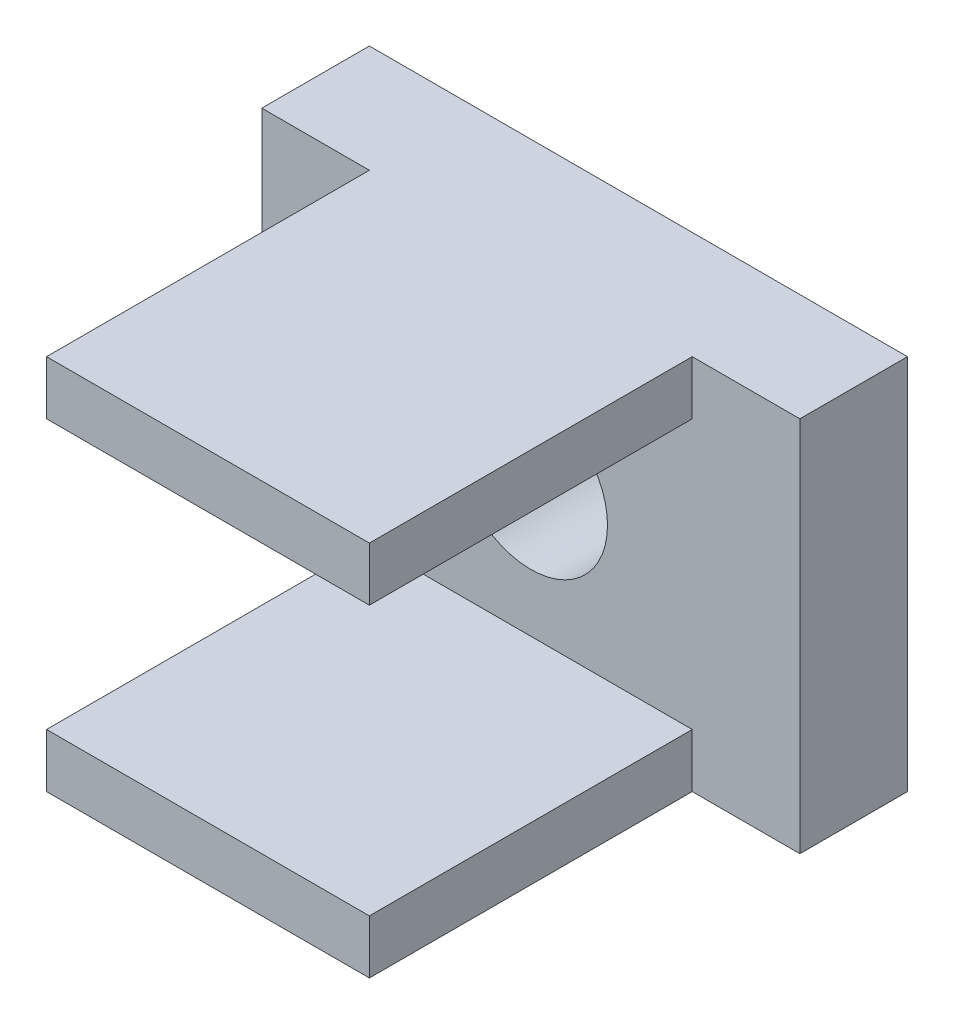
ISO-10303-21;
HEADER;
FILE_DESCRIPTION(('STEP AP214'),'2;1');
FILE_NAME('part.step','',(''),(''),'','','');
FILE_SCHEMA(('AUTOMOTIVE_DESIGN { 1 0 10303 214 1 1 1 1 }'));
ENDSEC;
DATA;
#1=APPLICATION_CONTEXT('core data for automotive mechanical design processes');
#2=APPLICATION_PROTOCOL_DEFINITION('international standard','automotive_design',2000,#1);
#3=PRODUCT_CONTEXT('',#1,'mechanical');
#4=PRODUCT('Part','Part','',(#3));
#5=PRODUCT_RELATED_PRODUCT_CATEGORY('part','',(#4));
#6=PRODUCT_DEFINITION_FORMATION('','',#4);
#7=PRODUCT_DEFINITION_CONTEXT('part definition',#1,'design');
#8=PRODUCT_DEFINITION('design','',#6,#7);
#9=PRODUCT_DEFINITION_SHAPE('','',#8);
#10=(LENGTH_UNIT() NAMED_UNIT(*) SI_UNIT(.MILLI.,.METRE.));
#11=(NAMED_UNIT(*) PLANE_ANGLE_UNIT() SI_UNIT($,.RADIAN.));
#12=(NAMED_UNIT(*) SI_UNIT($,.STERADIAN.) SOLID_ANGLE_UNIT());
#13=UNCERTAINTY_MEASURE_WITH_UNIT(LENGTH_MEASURE(1.E-05),#10,'distance_accuracy_value','');
#14=(GEOMETRIC_REPRESENTATION_CONTEXT(3) GLOBAL_UNCERTAINTY_ASSIGNED_CONTEXT((#13)) GLOBAL_UNIT_ASSIGNED_CONTEXT((#10,
#11,#12)) REPRESENTATION_CONTEXT('',''));
#15=CARTESIAN_POINT('',(0.,0.,0.));
#16=DIRECTION('',(0.,0.,1.));
#17=DIRECTION('',(1.,0.,0.));
#18=AXIS2_PLACEMENT_3D('',#15,#16,#17);
#19=CARTESIAN_POINT('',(0.,0.,1.));
#20=DIRECTION('',(0.,0.,-1.));
#21=DIRECTION('',(-1.,0.,0.));
#22=AXIS2_PLACEMENT_3D('',#19,#20,#21);
#23=PLANE('',#22);
#24=CARTESIAN_POINT('',(0.,0.,1.));
#25=DIRECTION('',(0.,0.,1.));
#26=DIRECTION('',(1.,0.,0.));
#27=AXIS2_PLACEMENT_3D('',#24,#25,#26);
#28=CIRCLE('',#27,1.425);
#29=CARTESIAN_POINT('',(1.425,0.,1.));
#30=VERTEX_POINT('',#29);
#31=EDGE_CURVE('E200',#30,#30,#28,.T.);
#32=ORIENTED_EDGE('',*,*,#31,.F.);
#33=EDGE_LOOP('',(#32));
#34=FACE_BOUND('',#33,.T.);
#35=DIRECTION('',(0.,1.,0.));
#36=VECTOR('',#35,1.);
#37=CARTESIAN_POINT('',(3.,-3.5,1.));
#38=LINE('',#37,#36);
#39=CARTESIAN_POINT('',(3.,-3.5,1.));
#40=VERTEX_POINT('',#39);
#41=CARTESIAN_POINT('',(3.,-2.5,1.));
#42=VERTEX_POINT('',#41);
#43=EDGE_CURVE('E151',#40,#42,#38,.T.);
#44=ORIENTED_EDGE('',*,*,#43,.F.);
#45=DIRECTION('',(1.,0.,0.));
#46=VECTOR('',#45,1.);
#47=CARTESIAN_POINT('',(5.,-3.5,1.));
#48=LINE('',#47,#46);
#49=CARTESIAN_POINT('',(5.,-3.5,1.));
#50=VERTEX_POINT('',#49);
#51=EDGE_CURVE('E213',#40,#50,#48,.T.);
#52=ORIENTED_EDGE('',*,*,#51,.T.);
#53=DIRECTION('',(0.,1.,0.));
#54=VECTOR('',#53,1.);
#55=CARTESIAN_POINT('',(5.,3.5,1.));
#56=LINE('',#55,#54);
#57=CARTESIAN_POINT('',(5.,3.5,1.));
#58=VERTEX_POINT('',#57);
#59=EDGE_CURVE('E218',#50,#58,#56,.T.);
#60=ORIENTED_EDGE('',*,*,#59,.T.);
#61=DIRECTION('',(-1.,0.,0.));
#62=VECTOR('',#61,1.);
#63=CARTESIAN_POINT('',(5.,3.5,1.));
#64=LINE('',#63,#62);
#65=CARTESIAN_POINT('',(3.,3.5,1.));
#66=VERTEX_POINT('',#65);
#67=EDGE_CURVE('E222',#58,#66,#64,.T.);
#68=ORIENTED_EDGE('',*,*,#67,.T.);
#69=DIRECTION('',(0.,1.,0.));
#70=VECTOR('',#69,1.);
#71=CARTESIAN_POINT('',(3.,3.5,1.));
#72=LINE('',#71,#70);
#73=CARTESIAN_POINT('',(3.,2.5,1.));
#74=VERTEX_POINT('',#73);
#75=EDGE_CURVE('E169',#74,#66,#72,.T.);
#76=ORIENTED_EDGE('',*,*,#75,.F.);
#77=DIRECTION('',(1.,0.,0.));
#78=VECTOR('',#77,1.);
#79=CARTESIAN_POINT('',(-3.,2.5,1.));
#80=LINE('',#79,#78);
#81=CARTESIAN_POINT('',(-3.,2.5,1.));
#82=VERTEX_POINT('',#81);
#83=EDGE_CURVE('E158',#82,#74,#80,.T.);
#84=ORIENTED_EDGE('',*,*,#83,.F.);
#85=DIRECTION('',(0.,-1.,0.));
#86=VECTOR('',#85,1.);
#87=CARTESIAN_POINT('',(-3.,3.5,1.));
#88=LINE('',#87,#86);
#89=CARTESIAN_POINT('',(-3.,3.5,1.));
#90=VERTEX_POINT('',#89);
#91=EDGE_CURVE('E153',#90,#82,#88,.T.);
#92=ORIENTED_EDGE('',*,*,#91,.F.);
#93=CARTESIAN_POINT('',(-5.,3.5,1.));
#94=VERTEX_POINT('',#93);
#95=EDGE_CURVE('E221',#90,#94,#64,.T.);
#96=ORIENTED_EDGE('',*,*,#95,.T.);
#97=DIRECTION('',(0.,-1.,0.));
#98=VECTOR('',#97,1.);
#99=CARTESIAN_POINT('',(-5.,3.5,1.));
#100=LINE('',#99,#98);
#101=CARTESIAN_POINT('',(-5.,-3.5,1.));
#102=VERTEX_POINT('',#101);
#103=EDGE_CURVE('E209',#94,#102,#100,.T.);
#104=ORIENTED_EDGE('',*,*,#103,.T.);
#105=CARTESIAN_POINT('',(-3.,-3.5,1.));
#106=VERTEX_POINT('',#105);
#107=EDGE_CURVE('E215',#102,#106,#48,.T.);
#108=ORIENTED_EDGE('',*,*,#107,.T.);
#109=DIRECTION('',(0.,-1.,0.));
#110=VECTOR('',#109,1.);
#111=CARTESIAN_POINT('',(-3.,-3.5,1.));
#112=LINE('',#111,#110);
#113=CARTESIAN_POINT('',(-3.,-2.5,1.));
#114=VERTEX_POINT('',#113);
#115=EDGE_CURVE('E60',#114,#106,#112,.T.);
#116=ORIENTED_EDGE('',*,*,#115,.F.);
#117=DIRECTION('',(-1.,0.,0.));
#118=VECTOR('',#117,1.);
#119=CARTESIAN_POINT('',(3.,-2.5,1.));
#120=LINE('',#119,#118);
#121=EDGE_CURVE('E55',#42,#114,#120,.T.);
#122=ORIENTED_EDGE('',*,*,#121,.F.);
#123=EDGE_LOOP('',(#44,#52,#60,#68,#76,#84,#92,#96,#104,#108,#116,#122));
#124=FACE_BOUND('',#123,.T.);
#125=ADVANCED_FACE('F39',(#34,#124),#23,.F.);
#126=CARTESIAN_POINT('',(-5.,3.5,1.));
#127=DIRECTION('',(1.,0.,0.));
#128=DIRECTION('',(0.,1.,0.));
#129=AXIS2_PLACEMENT_3D('',#126,#127,#128);
#130=PLANE('',#129);
#131=DIRECTION('',(0.,-1.,0.));
#132=VECTOR('',#131,1.);
#133=CARTESIAN_POINT('',(-5.,3.5,-1.));
#134=LINE('',#133,#132);
#135=CARTESIAN_POINT('',(-5.,3.5,-1.));
#136=VERTEX_POINT('',#135);
#137=CARTESIAN_POINT('',(-5.,-3.5,-1.));
#138=VERTEX_POINT('',#137);
#139=EDGE_CURVE('E205',#136,#138,#134,.T.);
#140=ORIENTED_EDGE('',*,*,#139,.T.);
#141=DIRECTION('',(0.,0.,-1.));
#142=VECTOR('',#141,1.);
#143=CARTESIAN_POINT('',(-5.,-3.5,1.));
#144=LINE('',#143,#142);
#145=EDGE_CURVE('E11',#102,#138,#144,.T.);
#146=ORIENTED_EDGE('',*,*,#145,.F.);
#147=ORIENTED_EDGE('',*,*,#103,.F.);
#148=DIRECTION('',(0.,0.,-1.));
#149=VECTOR('',#148,1.);
#150=CARTESIAN_POINT('',(-5.,3.5,1.));
#151=LINE('',#150,#149);
#152=EDGE_CURVE('E225',#94,#136,#151,.T.);
#153=ORIENTED_EDGE('',*,*,#152,.T.);
#154=EDGE_LOOP('',(#140,#146,#147,#153));
#155=FACE_BOUND('',#154,.T.);
#156=ADVANCED_FACE('F41',(#155),#130,.F.);
#157=CARTESIAN_POINT('',(5.,-3.5,1.));
#158=DIRECTION('',(0.,1.,0.));
#159=DIRECTION('',(-1.,0.,0.));
#160=AXIS2_PLACEMENT_3D('',#157,#158,#159);
#161=PLANE('',#160);
#162=DIRECTION('',(1.,0.,0.));
#163=VECTOR('',#162,1.);
#164=CARTESIAN_POINT('',(5.,-3.5,-1.));
#165=LINE('',#164,#163);
#166=CARTESIAN_POINT('',(5.,-3.5,-1.));
#167=VERTEX_POINT('',#166);
#168=EDGE_CURVE('E229',#138,#167,#165,.T.);
#169=ORIENTED_EDGE('',*,*,#168,.T.);
#170=DIRECTION('',(0.,0.,-1.));
#171=VECTOR('',#170,1.);
#172=CARTESIAN_POINT('',(5.,-3.5,1.));
#173=LINE('',#172,#171);
#174=EDGE_CURVE('E48',#50,#167,#173,.T.);
#175=ORIENTED_EDGE('',*,*,#174,.F.);
#176=ORIENTED_EDGE('',*,*,#51,.F.);
#177=DIRECTION('',(0.,0.,-1.));
#178=VECTOR('',#177,1.);
#179=CARTESIAN_POINT('',(3.,-3.5,7.));
#180=LINE('',#179,#178);
#181=CARTESIAN_POINT('',(3.,-3.5,7.));
#182=VERTEX_POINT('',#181);
#183=EDGE_CURVE('E268',#182,#40,#180,.T.);
#184=ORIENTED_EDGE('',*,*,#183,.F.);
#185=DIRECTION('',(1.,0.,0.));
#186=VECTOR('',#185,1.);
#187=CARTESIAN_POINT('',(3.,-3.5,7.));
#188=LINE('',#187,#186);
#189=CARTESIAN_POINT('',(-3.,-3.5,7.));
#190=VERTEX_POINT('',#189);
#191=EDGE_CURVE('E144',#190,#182,#188,.T.);
#192=ORIENTED_EDGE('',*,*,#191,.F.);
#193=DIRECTION('',(0.,0.,-1.));
#194=VECTOR('',#193,1.);
#195=CARTESIAN_POINT('',(-3.,-3.5,7.));
#196=LINE('',#195,#194);
#197=EDGE_CURVE('E160',#190,#106,#196,.T.);
#198=ORIENTED_EDGE('',*,*,#197,.T.);
#199=ORIENTED_EDGE('',*,*,#107,.F.);
#200=ORIENTED_EDGE('',*,*,#145,.T.);
#201=EDGE_LOOP('',(#169,#175,#176,#184,#192,#198,#199,#200));
#202=FACE_BOUND('',#201,.T.);
#203=ADVANCED_FACE('F267',(#202),#161,.F.);
#204=CARTESIAN_POINT('',(5.,3.5,1.));
#205=DIRECTION('',(-1.,0.,0.));
#206=DIRECTION('',(0.,-1.,0.));
#207=AXIS2_PLACEMENT_3D('',#204,#205,#206);
#208=PLANE('',#207);
#209=DIRECTION('',(0.,1.,0.));
#210=VECTOR('',#209,1.);
#211=CARTESIAN_POINT('',(5.,3.5,-1.));
#212=LINE('',#211,#210);
#213=CARTESIAN_POINT('',(5.,3.5,-1.));
#214=VERTEX_POINT('',#213);
#215=EDGE_CURVE('E232',#167,#214,#212,.T.);
#216=ORIENTED_EDGE('',*,*,#215,.T.);
#217=DIRECTION('',(0.,0.,-1.));
#218=VECTOR('',#217,1.);
#219=CARTESIAN_POINT('',(5.,3.5,1.));
#220=LINE('',#219,#218);
#221=EDGE_CURVE('E240',#58,#214,#220,.T.);
#222=ORIENTED_EDGE('',*,*,#221,.F.);
#223=ORIENTED_EDGE('',*,*,#59,.F.);
#224=ORIENTED_EDGE('',*,*,#174,.T.);
#225=EDGE_LOOP('',(#216,#222,#223,#224));
#226=FACE_BOUND('',#225,.T.);
#227=ADVANCED_FACE('F249',(#226),#208,.F.);
#228=CARTESIAN_POINT('',(5.,3.5,1.));
#229=DIRECTION('',(0.,-1.,0.));
#230=DIRECTION('',(1.,0.,0.));
#231=AXIS2_PLACEMENT_3D('',#228,#229,#230);
#232=PLANE('',#231);
#233=DIRECTION('',(-1.,0.,0.));
#234=VECTOR('',#233,1.);
#235=CARTESIAN_POINT('',(5.,3.5,-1.));
#236=LINE('',#235,#234);
#237=EDGE_CURVE('E214',#214,#136,#236,.T.);
#238=ORIENTED_EDGE('',*,*,#237,.T.);
#239=ORIENTED_EDGE('',*,*,#152,.F.);
#240=ORIENTED_EDGE('',*,*,#95,.F.);
#241=DIRECTION('',(0.,0.,-1.));
#242=VECTOR('',#241,1.);
#243=CARTESIAN_POINT('',(-3.,3.5,7.));
#244=LINE('',#243,#242);
#245=CARTESIAN_POINT('',(-3.,3.5,7.));
#246=VERTEX_POINT('',#245);
#247=EDGE_CURVE('E177',#246,#90,#244,.T.);
#248=ORIENTED_EDGE('',*,*,#247,.F.);
#249=DIRECTION('',(-1.,0.,0.));
#250=VECTOR('',#249,1.);
#251=CARTESIAN_POINT('',(-3.,3.5,7.));
#252=LINE('',#251,#250);
#253=CARTESIAN_POINT('',(3.,3.5,7.));
#254=VERTEX_POINT('',#253);
#255=EDGE_CURVE('E175',#254,#246,#252,.T.);
#256=ORIENTED_EDGE('',*,*,#255,.F.);
#257=DIRECTION('',(0.,0.,-1.));
#258=VECTOR('',#257,1.);
#259=CARTESIAN_POINT('',(3.,3.5,7.));
#260=LINE('',#259,#258);
#261=EDGE_CURVE('E188',#254,#66,#260,.T.);
#262=ORIENTED_EDGE('',*,*,#261,.T.);
#263=ORIENTED_EDGE('',*,*,#67,.F.);
#264=ORIENTED_EDGE('',*,*,#221,.T.);
#265=EDGE_LOOP('',(#238,#239,#240,#248,#256,#262,#263,#264));
#266=FACE_BOUND('',#265,.T.);
#267=ADVANCED_FACE('F258',(#266),#232,.F.);
#268=CARTESIAN_POINT('',(0.,0.,-1.));
#269=DIRECTION('',(0.,0.,-1.));
#270=DIRECTION('',(-1.,0.,0.));
#271=AXIS2_PLACEMENT_3D('',#268,#269,#270);
#272=PLANE('',#271);
#273=CARTESIAN_POINT('',(0.,0.,-1.));
#274=DIRECTION('',(0.,0.,1.));
#275=DIRECTION('',(1.,0.,0.));
#276=AXIS2_PLACEMENT_3D('',#273,#274,#275);
#277=CIRCLE('',#276,1.425);
#278=CARTESIAN_POINT('',(1.425,0.,-1.));
#279=VERTEX_POINT('',#278);
#280=EDGE_CURVE('E201',#279,#279,#277,.T.);
#281=ORIENTED_EDGE('',*,*,#280,.T.);
#282=EDGE_LOOP('',(#281));
#283=FACE_BOUND('',#282,.T.);
#284=ORIENTED_EDGE('',*,*,#139,.F.);
#285=ORIENTED_EDGE('',*,*,#237,.F.);
#286=ORIENTED_EDGE('',*,*,#215,.F.);
#287=ORIENTED_EDGE('',*,*,#168,.F.);
#288=EDGE_LOOP('',(#284,#285,#286,#287));
#289=FACE_BOUND('',#288,.T.);
#290=ADVANCED_FACE('F255',(#283,#289),#272,.T.);
#291=CARTESIAN_POINT('',(0.,0.,-1.));
#292=DIRECTION('',(0.,0.,1.));
#293=DIRECTION('',(1.,0.,0.));
#294=AXIS2_PLACEMENT_3D('',#291,#292,#293);
#295=CYLINDRICAL_SURFACE('',#294,1.425);
#296=ORIENTED_EDGE('',*,*,#280,.F.);
#297=EDGE_LOOP('',(#296));
#298=FACE_BOUND('',#297,.T.);
#299=ORIENTED_EDGE('',*,*,#31,.T.);
#300=EDGE_LOOP('',(#299));
#301=FACE_BOUND('',#300,.T.);
#302=ADVANCED_FACE('F303',(#298,#301),#295,.F.);
#303=CARTESIAN_POINT('',(-3.,3.5,7.));
#304=DIRECTION('',(1.,0.,0.));
#305=DIRECTION('',(0.,0.,-1.));
#306=AXIS2_PLACEMENT_3D('',#303,#304,#305);
#307=PLANE('',#306);
#308=ORIENTED_EDGE('',*,*,#91,.T.);
#309=DIRECTION('',(0.,0.,-1.));
#310=VECTOR('',#309,1.);
#311=CARTESIAN_POINT('',(-3.,2.5,7.));
#312=LINE('',#311,#310);
#313=CARTESIAN_POINT('',(-3.,2.5,7.));
#314=VERTEX_POINT('',#313);
#315=EDGE_CURVE('E196',#314,#82,#312,.T.);
#316=ORIENTED_EDGE('',*,*,#315,.F.);
#317=DIRECTION('',(0.,-1.,0.));
#318=VECTOR('',#317,1.);
#319=CARTESIAN_POINT('',(-3.,3.5,7.));
#320=LINE('',#319,#318);
#321=EDGE_CURVE('E164',#246,#314,#320,.T.);
#322=ORIENTED_EDGE('',*,*,#321,.F.);
#323=ORIENTED_EDGE('',*,*,#247,.T.);
#324=EDGE_LOOP('',(#308,#316,#322,#323));
#325=FACE_BOUND('',#324,.T.);
#326=ADVANCED_FACE('F335',(#325),#307,.F.);
#327=CARTESIAN_POINT('',(-3.,2.5,7.));
#328=DIRECTION('',(0.,1.,0.));
#329=DIRECTION('',(-1.,0.,0.));
#330=AXIS2_PLACEMENT_3D('',#327,#328,#329);
#331=PLANE('',#330);
#332=ORIENTED_EDGE('',*,*,#83,.T.);
#333=DIRECTION('',(0.,0.,-1.));
#334=VECTOR('',#333,1.);
#335=CARTESIAN_POINT('',(3.,2.5,7.));
#336=LINE('',#335,#334);
#337=CARTESIAN_POINT('',(3.,2.5,7.));
#338=VERTEX_POINT('',#337);
#339=EDGE_CURVE('E192',#338,#74,#336,.T.);
#340=ORIENTED_EDGE('',*,*,#339,.F.);
#341=DIRECTION('',(1.,0.,0.));
#342=VECTOR('',#341,1.);
#343=CARTESIAN_POINT('',(-3.,2.5,7.));
#344=LINE('',#343,#342);
#345=EDGE_CURVE('E168',#314,#338,#344,.T.);
#346=ORIENTED_EDGE('',*,*,#345,.F.);
#347=ORIENTED_EDGE('',*,*,#315,.T.);
#348=EDGE_LOOP('',(#332,#340,#346,#347));
#349=FACE_BOUND('',#348,.T.);
#350=ADVANCED_FACE('F341',(#349),#331,.F.);
#351=CARTESIAN_POINT('',(3.,3.5,7.));
#352=DIRECTION('',(-1.,0.,0.));
#353=DIRECTION('',(0.,-1.,0.));
#354=AXIS2_PLACEMENT_3D('',#351,#352,#353);
#355=PLANE('',#354);
#356=ORIENTED_EDGE('',*,*,#75,.T.);
#357=ORIENTED_EDGE('',*,*,#261,.F.);
#358=DIRECTION('',(0.,1.,0.));
#359=VECTOR('',#358,1.);
#360=CARTESIAN_POINT('',(3.,3.5,7.));
#361=LINE('',#360,#359);
#362=EDGE_CURVE('E172',#338,#254,#361,.T.);
#363=ORIENTED_EDGE('',*,*,#362,.F.);
#364=ORIENTED_EDGE('',*,*,#339,.T.);
#365=EDGE_LOOP('',(#356,#357,#363,#364));
#366=FACE_BOUND('',#365,.T.);
#367=ADVANCED_FACE('F348',(#366),#355,.F.);
#368=CARTESIAN_POINT('',(0.,0.,7.));
#369=DIRECTION('',(0.,0.,1.));
#370=DIRECTION('',(1.,0.,0.));
#371=AXIS2_PLACEMENT_3D('',#368,#369,#370);
#372=PLANE('',#371);
#373=ORIENTED_EDGE('',*,*,#321,.T.);
#374=ORIENTED_EDGE('',*,*,#345,.T.);
#375=ORIENTED_EDGE('',*,*,#362,.T.);
#376=ORIENTED_EDGE('',*,*,#255,.T.);
#377=EDGE_LOOP('',(#373,#374,#375,#376));
#378=FACE_BOUND('',#377,.T.);
#379=ADVANCED_FACE('F356',(#378),#372,.T.);
#380=CARTESIAN_POINT('',(3.,-3.5,7.));
#381=DIRECTION('',(-1.,0.,0.));
#382=DIRECTION('',(0.,0.,1.));
#383=AXIS2_PLACEMENT_3D('',#380,#381,#382);
#384=PLANE('',#383);
#385=ORIENTED_EDGE('',*,*,#43,.T.);
#386=DIRECTION('',(0.,0.,-1.));
#387=VECTOR('',#386,1.);
#388=CARTESIAN_POINT('',(3.,-2.5,7.));
#389=LINE('',#388,#387);
#390=CARTESIAN_POINT('',(3.,-2.5,7.));
#391=VERTEX_POINT('',#390);
#392=EDGE_CURVE('E131',#391,#42,#389,.T.);
#393=ORIENTED_EDGE('',*,*,#392,.F.);
#394=DIRECTION('',(0.,1.,0.));
#395=VECTOR('',#394,1.);
#396=CARTESIAN_POINT('',(3.,-3.5,7.));
#397=LINE('',#396,#395);
#398=EDGE_CURVE('E139',#182,#391,#397,.T.);
#399=ORIENTED_EDGE('',*,*,#398,.F.);
#400=ORIENTED_EDGE('',*,*,#183,.T.);
#401=EDGE_LOOP('',(#385,#393,#399,#400));
#402=FACE_BOUND('',#401,.T.);
#403=ADVANCED_FACE('F150',(#402),#384,.F.);
#404=CARTESIAN_POINT('',(3.,-2.5,7.));
#405=DIRECTION('',(0.,-1.,0.));
#406=DIRECTION('',(0.,0.,-1.));
#407=AXIS2_PLACEMENT_3D('',#404,#405,#406);
#408=PLANE('',#407);
#409=ORIENTED_EDGE('',*,*,#121,.T.);
#410=DIRECTION('',(0.,0.,-1.));
#411=VECTOR('',#410,1.);
#412=CARTESIAN_POINT('',(-3.,-2.5,7.));
#413=LINE('',#412,#411);
#414=CARTESIAN_POINT('',(-3.,-2.5,7.));
#415=VERTEX_POINT('',#414);
#416=EDGE_CURVE('E134',#415,#114,#413,.T.);
#417=ORIENTED_EDGE('',*,*,#416,.F.);
#418=DIRECTION('',(-1.,0.,0.));
#419=VECTOR('',#418,1.);
#420=CARTESIAN_POINT('',(3.,-2.5,7.));
#421=LINE('',#420,#419);
#422=EDGE_CURVE('E127',#391,#415,#421,.T.);
#423=ORIENTED_EDGE('',*,*,#422,.F.);
#424=ORIENTED_EDGE('',*,*,#392,.T.);
#425=EDGE_LOOP('',(#409,#417,#423,#424));
#426=FACE_BOUND('',#425,.T.);
#427=ADVANCED_FACE('F129',(#426),#408,.F.);
#428=CARTESIAN_POINT('',(-3.,-3.5,7.));
#429=DIRECTION('',(1.,0.,0.));
#430=DIRECTION('',(0.,0.,-1.));
#431=AXIS2_PLACEMENT_3D('',#428,#429,#430);
#432=PLANE('',#431);
#433=ORIENTED_EDGE('',*,*,#115,.T.);
#434=ORIENTED_EDGE('',*,*,#197,.F.);
#435=DIRECTION('',(0.,-1.,0.));
#436=VECTOR('',#435,1.);
#437=CARTESIAN_POINT('',(-3.,-3.5,7.));
#438=LINE('',#437,#436);
#439=EDGE_CURVE('E138',#415,#190,#438,.T.);
#440=ORIENTED_EDGE('',*,*,#439,.F.);
#441=ORIENTED_EDGE('',*,*,#416,.T.);
#442=EDGE_LOOP('',(#433,#434,#440,#441));
#443=FACE_BOUND('',#442,.T.);
#444=ADVANCED_FACE('F285',(#443),#432,.F.);
#445=CARTESIAN_POINT('',(0.,0.,7.));
#446=DIRECTION('',(0.,0.,1.));
#447=DIRECTION('',(1.,0.,0.));
#448=AXIS2_PLACEMENT_3D('',#445,#446,#447);
#449=PLANE('',#448);
#450=ORIENTED_EDGE('',*,*,#398,.T.);
#451=ORIENTED_EDGE('',*,*,#422,.T.);
#452=ORIENTED_EDGE('',*,*,#439,.T.);
#453=ORIENTED_EDGE('',*,*,#191,.T.);
#454=EDGE_LOOP('',(#450,#451,#452,#453));
#455=FACE_BOUND('',#454,.T.);
#456=ADVANCED_FACE('F142',(#455),#449,.T.);
#457=CLOSED_SHELL('',(#125,#156,#203,#227,#267,#290,#302,#326,#350,#367,#379,#403,#427,#444,#456));
#458=MANIFOLD_SOLID_BREP('B2',#457);
#459=ADVANCED_BREP_SHAPE_REPRESENTATION('',(#18,#458),#14);
#460=SHAPE_DEFINITION_REPRESENTATION(#9,#459);
ENDSEC;
END-ISO-10303-21;
